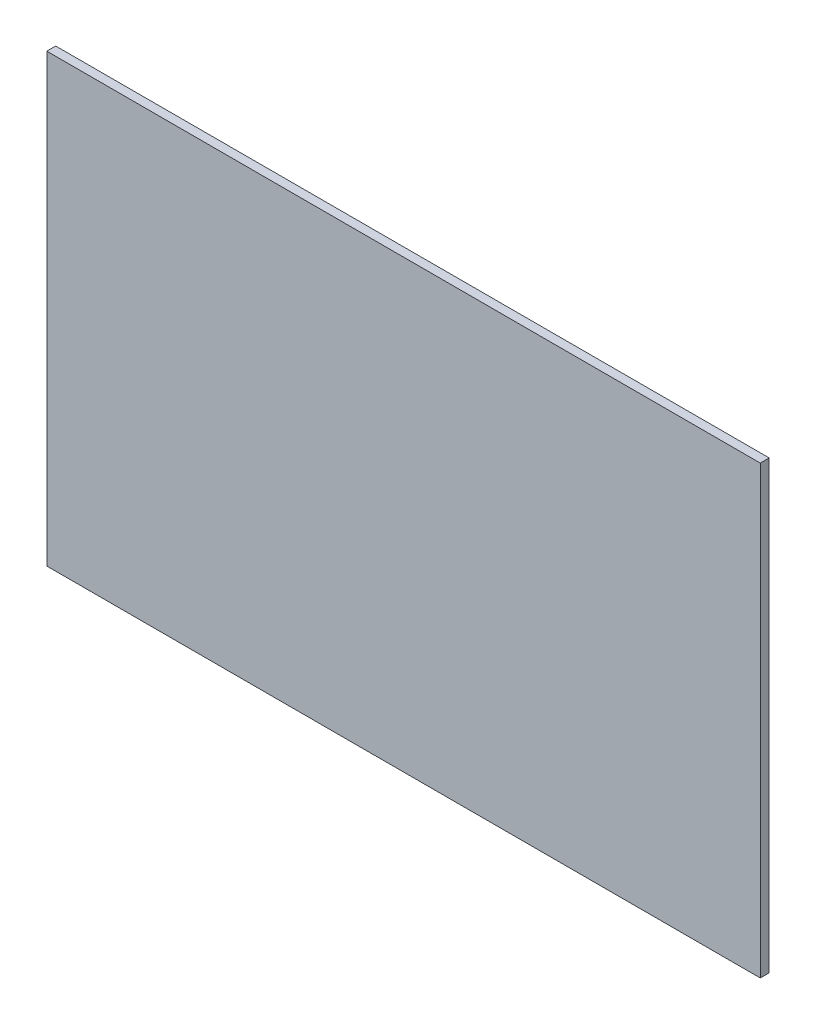
ISO-10303-21;
HEADER;
FILE_DESCRIPTION(('STEP AP214'),'2;1');
FILE_NAME('part.step','',(''),(''),'','','');
FILE_SCHEMA(('AUTOMOTIVE_DESIGN { 1 0 10303 214 1 1 1 1 }'));
ENDSEC;
DATA;
#1=APPLICATION_CONTEXT('core data for automotive mechanical design processes');
#2=APPLICATION_PROTOCOL_DEFINITION('international standard','automotive_design',2000,#1);
#3=PRODUCT_CONTEXT('',#1,'mechanical');
#4=PRODUCT('Part','Part','',(#3));
#5=PRODUCT_RELATED_PRODUCT_CATEGORY('part','',(#4));
#6=PRODUCT_DEFINITION_FORMATION('','',#4);
#7=PRODUCT_DEFINITION_CONTEXT('part definition',#1,'design');
#8=PRODUCT_DEFINITION('design','',#6,#7);
#9=PRODUCT_DEFINITION_SHAPE('','',#8);
#10=(LENGTH_UNIT() NAMED_UNIT(*) SI_UNIT(.MILLI.,.METRE.));
#11=(NAMED_UNIT(*) PLANE_ANGLE_UNIT() SI_UNIT($,.RADIAN.));
#12=(NAMED_UNIT(*) SI_UNIT($,.STERADIAN.) SOLID_ANGLE_UNIT());
#13=UNCERTAINTY_MEASURE_WITH_UNIT(LENGTH_MEASURE(1.E-05),#10,'distance_accuracy_value','');
#14=(GEOMETRIC_REPRESENTATION_CONTEXT(3) GLOBAL_UNCERTAINTY_ASSIGNED_CONTEXT((#13)) GLOBAL_UNIT_ASSIGNED_CONTEXT((#10,
#11,#12)) REPRESENTATION_CONTEXT('',''));
#15=CARTESIAN_POINT('',(0.,0.,0.));
#16=DIRECTION('',(0.,0.,1.));
#17=DIRECTION('',(1.,0.,0.));
#18=AXIS2_PLACEMENT_3D('',#15,#16,#17);
#19=CARTESIAN_POINT('',(400.,250.,10.));
#20=DIRECTION('',(-1.,0.,0.));
#21=DIRECTION('',(0.,-1.,0.));
#22=AXIS2_PLACEMENT_3D('',#19,#20,#21);
#23=PLANE('',#22);
#24=DIRECTION('',(0.,1.,0.));
#25=VECTOR('',#24,1.);
#26=CARTESIAN_POINT('',(400.,250.,0.));
#27=LINE('',#26,#25);
#28=CARTESIAN_POINT('',(400.,-250.,0.));
#29=VERTEX_POINT('',#28);
#30=CARTESIAN_POINT('',(400.,250.,0.));
#31=VERTEX_POINT('',#30);
#32=EDGE_CURVE('E96',#29,#31,#27,.T.);
#33=ORIENTED_EDGE('',*,*,#32,.T.);
#34=DIRECTION('',(0.,0.,-1.));
#35=VECTOR('',#34,1.);
#36=CARTESIAN_POINT('',(400.,250.,10.));
#37=LINE('',#36,#35);
#38=CARTESIAN_POINT('',(400.,250.,10.));
#39=VERTEX_POINT('',#38);
#40=EDGE_CURVE('E11',#39,#31,#37,.T.);
#41=ORIENTED_EDGE('',*,*,#40,.F.);
#42=DIRECTION('',(0.,1.,0.));
#43=VECTOR('',#42,1.);
#44=CARTESIAN_POINT('',(400.,250.,10.));
#45=LINE('',#44,#43);
#46=CARTESIAN_POINT('',(400.,-250.,10.));
#47=VERTEX_POINT('',#46);
#48=EDGE_CURVE('E84',#47,#39,#45,.T.);
#49=ORIENTED_EDGE('',*,*,#48,.F.);
#50=DIRECTION('',(0.,0.,-1.));
#51=VECTOR('',#50,1.);
#52=CARTESIAN_POINT('',(400.,-250.,10.));
#53=LINE('',#52,#51);
#54=EDGE_CURVE('E92',#47,#29,#53,.T.);
#55=ORIENTED_EDGE('',*,*,#54,.T.);
#56=EDGE_LOOP('',(#33,#41,#49,#55));
#57=FACE_BOUND('',#56,.T.);
#58=ADVANCED_FACE('F33',(#57),#23,.F.);
#59=CARTESIAN_POINT('',(-400.,250.,10.));
#60=DIRECTION('',(0.,-1.,0.));
#61=DIRECTION('',(0.,0.,-1.));
#62=AXIS2_PLACEMENT_3D('',#59,#60,#61);
#63=PLANE('',#62);
#64=DIRECTION('',(-1.,0.,0.));
#65=VECTOR('',#64,1.);
#66=CARTESIAN_POINT('',(-400.,250.,0.));
#67=LINE('',#66,#65);
#68=CARTESIAN_POINT('',(-400.,250.,0.));
#69=VERTEX_POINT('',#68);
#70=EDGE_CURVE('E88',#31,#69,#67,.T.);
#71=ORIENTED_EDGE('',*,*,#70,.T.);
#72=DIRECTION('',(0.,0.,-1.));
#73=VECTOR('',#72,1.);
#74=CARTESIAN_POINT('',(-400.,250.,10.));
#75=LINE('',#74,#73);
#76=CARTESIAN_POINT('',(-400.,250.,10.));
#77=VERTEX_POINT('',#76);
#78=EDGE_CURVE('E41',#77,#69,#75,.T.);
#79=ORIENTED_EDGE('',*,*,#78,.F.);
#80=DIRECTION('',(-1.,0.,0.));
#81=VECTOR('',#80,1.);
#82=CARTESIAN_POINT('',(-400.,250.,10.));
#83=LINE('',#82,#81);
#84=EDGE_CURVE('E79',#39,#77,#83,.T.);
#85=ORIENTED_EDGE('',*,*,#84,.F.);
#86=ORIENTED_EDGE('',*,*,#40,.T.);
#87=EDGE_LOOP('',(#71,#79,#85,#86));
#88=FACE_BOUND('',#87,.T.);
#89=ADVANCED_FACE('F87',(#88),#63,.F.);
#90=CARTESIAN_POINT('',(-400.,250.,10.));
#91=DIRECTION('',(1.,0.,0.));
#92=DIRECTION('',(0.,1.,0.));
#93=AXIS2_PLACEMENT_3D('',#90,#91,#92);
#94=PLANE('',#93);
#95=DIRECTION('',(0.,-1.,0.));
#96=VECTOR('',#95,1.);
#97=CARTESIAN_POINT('',(-400.,250.,0.));
#98=LINE('',#97,#96);
#99=CARTESIAN_POINT('',(-400.,-250.,0.));
#100=VERTEX_POINT('',#99);
#101=EDGE_CURVE('E66',#69,#100,#98,.T.);
#102=ORIENTED_EDGE('',*,*,#101,.T.);
#103=DIRECTION('',(0.,0.,-1.));
#104=VECTOR('',#103,1.);
#105=CARTESIAN_POINT('',(-400.,-250.,10.));
#106=LINE('',#105,#104);
#107=CARTESIAN_POINT('',(-400.,-250.,10.));
#108=VERTEX_POINT('',#107);
#109=EDGE_CURVE('E89',#108,#100,#106,.T.);
#110=ORIENTED_EDGE('',*,*,#109,.F.);
#111=DIRECTION('',(0.,-1.,0.));
#112=VECTOR('',#111,1.);
#113=CARTESIAN_POINT('',(-400.,250.,10.));
#114=LINE('',#113,#112);
#115=EDGE_CURVE('E82',#77,#108,#114,.T.);
#116=ORIENTED_EDGE('',*,*,#115,.F.);
#117=ORIENTED_EDGE('',*,*,#78,.T.);
#118=EDGE_LOOP('',(#102,#110,#116,#117));
#119=FACE_BOUND('',#118,.T.);
#120=ADVANCED_FACE('F90',(#119),#94,.F.);
#121=CARTESIAN_POINT('',(-400.,-250.,10.));
#122=DIRECTION('',(0.,1.,0.));
#123=DIRECTION('',(0.,0.,1.));
#124=AXIS2_PLACEMENT_3D('',#121,#122,#123);
#125=PLANE('',#124);
#126=DIRECTION('',(1.,0.,0.));
#127=VECTOR('',#126,1.);
#128=CARTESIAN_POINT('',(-400.,-250.,0.));
#129=LINE('',#128,#127);
#130=EDGE_CURVE('E72',#100,#29,#129,.T.);
#131=ORIENTED_EDGE('',*,*,#130,.T.);
#132=ORIENTED_EDGE('',*,*,#54,.F.);
#133=DIRECTION('',(1.,0.,0.));
#134=VECTOR('',#133,1.);
#135=CARTESIAN_POINT('',(-400.,-250.,10.));
#136=LINE('',#135,#134);
#137=EDGE_CURVE('E49',#108,#47,#136,.T.);
#138=ORIENTED_EDGE('',*,*,#137,.F.);
#139=ORIENTED_EDGE('',*,*,#109,.T.);
#140=EDGE_LOOP('',(#131,#132,#138,#139));
#141=FACE_BOUND('',#140,.T.);
#142=ADVANCED_FACE('F103',(#141),#125,.F.);
#143=CARTESIAN_POINT('',(0.,0.,10.));
#144=DIRECTION('',(0.,0.,1.));
#145=DIRECTION('',(1.,0.,0.));
#146=AXIS2_PLACEMENT_3D('',#143,#144,#145);
#147=PLANE('',#146);
#148=ORIENTED_EDGE('',*,*,#48,.T.);
#149=ORIENTED_EDGE('',*,*,#84,.T.);
#150=ORIENTED_EDGE('',*,*,#115,.T.);
#151=ORIENTED_EDGE('',*,*,#137,.T.);
#152=EDGE_LOOP('',(#148,#149,#150,#151));
#153=FACE_BOUND('',#152,.T.);
#154=ADVANCED_FACE('F80',(#153),#147,.T.);
#155=CARTESIAN_POINT('',(0.,0.,0.));
#156=DIRECTION('',(0.,0.,1.));
#157=DIRECTION('',(1.,0.,0.));
#158=AXIS2_PLACEMENT_3D('',#155,#156,#157);
#159=PLANE('',#158);
#160=ORIENTED_EDGE('',*,*,#32,.F.);
#161=ORIENTED_EDGE('',*,*,#130,.F.);
#162=ORIENTED_EDGE('',*,*,#101,.F.);
#163=ORIENTED_EDGE('',*,*,#70,.F.);
#164=EDGE_LOOP('',(#160,#161,#162,#163));
#165=FACE_BOUND('',#164,.T.);
#166=ADVANCED_FACE('F106',(#165),#159,.F.);
#167=CLOSED_SHELL('',(#58,#89,#120,#142,#154,#166));
#168=MANIFOLD_SOLID_BREP('B2',#167);
#169=ADVANCED_BREP_SHAPE_REPRESENTATION('',(#18,#168),#14);
#170=SHAPE_DEFINITION_REPRESENTATION(#9,#169);
ENDSEC;
END-ISO-10303-21;
